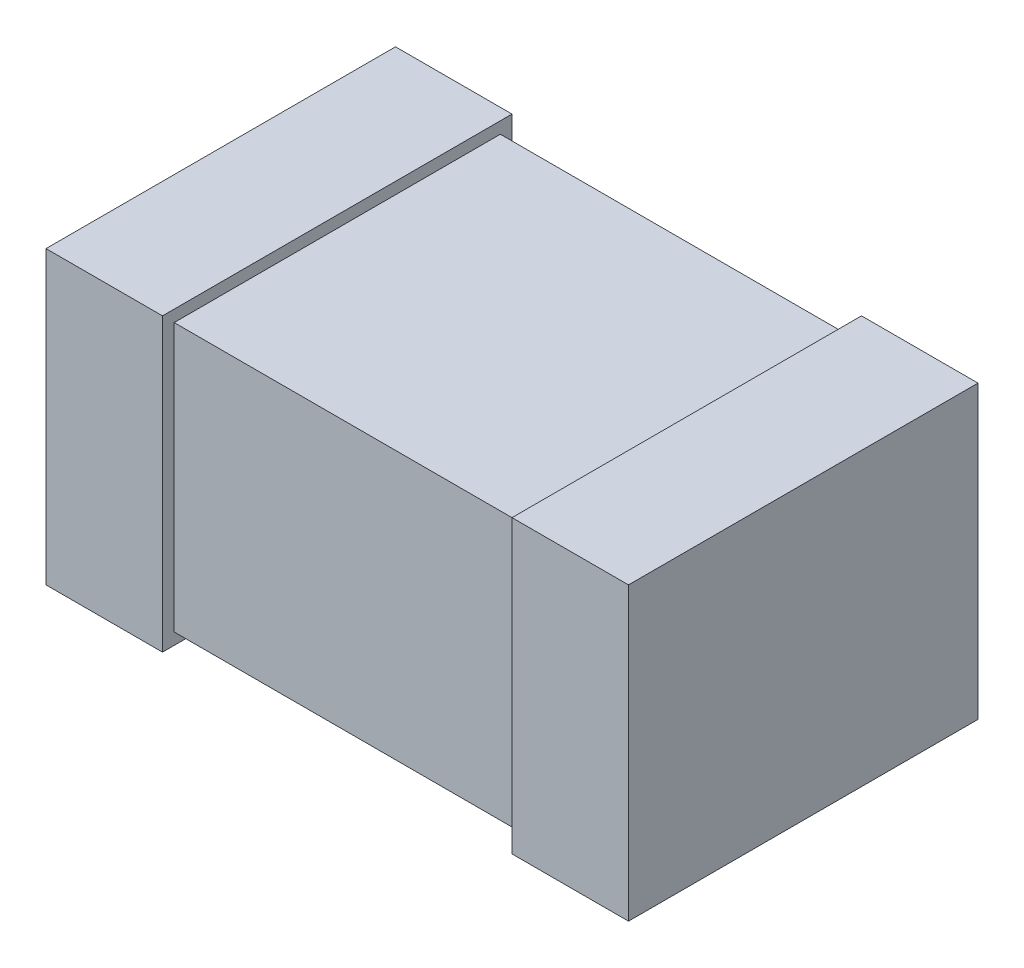
ISO-10303-21;
HEADER;
FILE_DESCRIPTION(('STEP AP214'),'2;1');
FILE_NAME('part.step','',(''),(''),'','','');
FILE_SCHEMA(('AUTOMOTIVE_DESIGN { 1 0 10303 214 1 1 1 1 }'));
ENDSEC;
DATA;
#1=APPLICATION_CONTEXT('core data for automotive mechanical design processes');
#2=APPLICATION_PROTOCOL_DEFINITION('international standard','automotive_design',2000,#1);
#3=PRODUCT_CONTEXT('',#1,'mechanical');
#4=PRODUCT('Part','Part','',(#3));
#5=PRODUCT_RELATED_PRODUCT_CATEGORY('part','',(#4));
#6=PRODUCT_DEFINITION_FORMATION('','',#4);
#7=PRODUCT_DEFINITION_CONTEXT('part definition',#1,'design');
#8=PRODUCT_DEFINITION('design','',#6,#7);
#9=PRODUCT_DEFINITION_SHAPE('','',#8);
#10=(LENGTH_UNIT() NAMED_UNIT(*) SI_UNIT(.MILLI.,.METRE.));
#11=(NAMED_UNIT(*) PLANE_ANGLE_UNIT() SI_UNIT($,.RADIAN.));
#12=(NAMED_UNIT(*) SI_UNIT($,.STERADIAN.) SOLID_ANGLE_UNIT());
#13=UNCERTAINTY_MEASURE_WITH_UNIT(LENGTH_MEASURE(1.E-05),#10,'distance_accuracy_value','');
#14=(GEOMETRIC_REPRESENTATION_CONTEXT(3) GLOBAL_UNCERTAINTY_ASSIGNED_CONTEXT((#13)) GLOBAL_UNIT_ASSIGNED_CONTEXT((#10,
#11,#12)) REPRESENTATION_CONTEXT('',''));
#15=CARTESIAN_POINT('',(0.,0.,0.));
#16=DIRECTION('',(0.,0.,1.));
#17=DIRECTION('',(1.,0.,0.));
#18=AXIS2_PLACEMENT_3D('',#15,#16,#17);
#19=CARTESIAN_POINT('',(0.5,-0.25,0.0762));
#20=DIRECTION('',(1.,0.,0.));
#21=DIRECTION('',(0.,1.,0.));
#22=AXIS2_PLACEMENT_3D('',#19,#20,#21);
#23=PLANE('',#22);
#24=DIRECTION('',(0.,1.,0.));
#25=VECTOR('',#24,1.);
#26=CARTESIAN_POINT('',(0.5,-0.25,0.0762));
#27=LINE('',#26,#25);
#28=CARTESIAN_POINT('',(0.5,-0.25,0.0762));
#29=VERTEX_POINT('',#28);
#30=CARTESIAN_POINT('',(0.5,0.25,0.0762));
#31=VERTEX_POINT('',#30);
#32=EDGE_CURVE('E196',#29,#31,#27,.T.);
#33=ORIENTED_EDGE('',*,*,#32,.T.);
#34=DIRECTION('',(0.,0.,1.));
#35=VECTOR('',#34,1.);
#36=CARTESIAN_POINT('',(0.5,0.25,0.0762));
#37=LINE('',#36,#35);
#38=CARTESIAN_POINT('',(0.5,0.25,0.6762));
#39=VERTEX_POINT('',#38);
#40=EDGE_CURVE('E168',#31,#39,#37,.T.);
#41=ORIENTED_EDGE('',*,*,#40,.T.);
#42=DIRECTION('',(0.,1.,0.));
#43=VECTOR('',#42,1.);
#44=CARTESIAN_POINT('',(0.5,-0.25,0.6762));
#45=LINE('',#44,#43);
#46=CARTESIAN_POINT('',(0.5,-0.25,0.6762));
#47=VERTEX_POINT('',#46);
#48=EDGE_CURVE('E163',#47,#39,#45,.T.);
#49=ORIENTED_EDGE('',*,*,#48,.F.);
#50=DIRECTION('',(0.,0.,1.));
#51=VECTOR('',#50,1.);
#52=CARTESIAN_POINT('',(0.5,-0.25,0.0762));
#53=LINE('',#52,#51);
#54=EDGE_CURVE('E178',#29,#47,#53,.T.);
#55=ORIENTED_EDGE('',*,*,#54,.F.);
#56=EDGE_LOOP('',(#33,#41,#49,#55));
#57=FACE_BOUND('',#56,.T.);
#58=ADVANCED_FACE('F16',(#57),#23,.T.);
#59=CARTESIAN_POINT('',(0.3,-0.23,0.0762));
#60=DIRECTION('',(0.,1.,0.));
#61=DIRECTION('',(1.,0.,0.));
#62=AXIS2_PLACEMENT_3D('',#59,#60,#61);
#63=PLANE('',#62);
#64=DIRECTION('',(-1.,0.,0.));
#65=VECTOR('',#64,1.);
#66=CARTESIAN_POINT('',(0.3,-0.23,0.6562));
#67=LINE('',#66,#65);
#68=CARTESIAN_POINT('',(0.3,-0.23,0.6562));
#69=VERTEX_POINT('',#68);
#70=CARTESIAN_POINT('',(-0.3,-0.23,0.6562));
#71=VERTEX_POINT('',#70);
#72=EDGE_CURVE('E11',#69,#71,#67,.T.);
#73=ORIENTED_EDGE('',*,*,#72,.T.);
#74=DIRECTION('',(0.,0.,-1.));
#75=VECTOR('',#74,1.);
#76=CARTESIAN_POINT('',(-0.3,-0.23,0.6562));
#77=LINE('',#76,#75);
#78=CARTESIAN_POINT('',(-0.3,-0.23,0.0962));
#79=VERTEX_POINT('',#78);
#80=EDGE_CURVE('E183',#71,#79,#77,.T.);
#81=ORIENTED_EDGE('',*,*,#80,.T.);
#82=DIRECTION('',(-1.,0.,0.));
#83=VECTOR('',#82,1.);
#84=CARTESIAN_POINT('',(0.3,-0.23,0.0962));
#85=LINE('',#84,#83);
#86=CARTESIAN_POINT('',(0.3,-0.23,0.0962));
#87=VERTEX_POINT('',#86);
#88=EDGE_CURVE('E217',#87,#79,#85,.T.);
#89=ORIENTED_EDGE('',*,*,#88,.F.);
#90=DIRECTION('',(0.,0.,-1.));
#91=VECTOR('',#90,1.);
#92=CARTESIAN_POINT('',(0.3,-0.23,0.6562));
#93=LINE('',#92,#91);
#94=EDGE_CURVE('E192',#69,#87,#93,.T.);
#95=ORIENTED_EDGE('',*,*,#94,.F.);
#96=EDGE_LOOP('',(#73,#81,#89,#95));
#97=FACE_BOUND('',#96,.T.);
#98=ADVANCED_FACE('F260',(#97),#63,.F.);
#99=CARTESIAN_POINT('',(0.3,0.25,0.6562));
#100=DIRECTION('',(0.,0.,-1.));
#101=DIRECTION('',(0.,-1.,0.));
#102=AXIS2_PLACEMENT_3D('',#99,#100,#101);
#103=PLANE('',#102);
#104=DIRECTION('',(1.,0.,0.));
#105=VECTOR('',#104,1.);
#106=CARTESIAN_POINT('',(-0.3,0.23,0.6562));
#107=LINE('',#106,#105);
#108=CARTESIAN_POINT('',(-0.3,0.23,0.6562));
#109=VERTEX_POINT('',#108);
#110=CARTESIAN_POINT('',(0.3,0.23,0.6562));
#111=VERTEX_POINT('',#110);
#112=EDGE_CURVE('E27',#109,#111,#107,.T.);
#113=ORIENTED_EDGE('',*,*,#112,.F.);
#114=DIRECTION('',(0.,-1.,0.));
#115=VECTOR('',#114,1.);
#116=CARTESIAN_POINT('',(-0.3,0.23,0.6562));
#117=LINE('',#116,#115);
#118=EDGE_CURVE('E184',#109,#71,#117,.T.);
#119=ORIENTED_EDGE('',*,*,#118,.T.);
#120=ORIENTED_EDGE('',*,*,#72,.F.);
#121=DIRECTION('',(0.,-1.,0.));
#122=VECTOR('',#121,1.);
#123=CARTESIAN_POINT('',(0.3,0.23,0.6562));
#124=LINE('',#123,#122);
#125=EDGE_CURVE('E188',#111,#69,#124,.T.);
#126=ORIENTED_EDGE('',*,*,#125,.F.);
#127=EDGE_LOOP('',(#113,#119,#120,#126));
#128=FACE_BOUND('',#127,.T.);
#129=ADVANCED_FACE('F265',(#128),#103,.F.);
#130=CARTESIAN_POINT('',(-0.3,0.23,0.0762));
#131=DIRECTION('',(0.,-1.,0.));
#132=DIRECTION('',(0.,0.,-1.));
#133=AXIS2_PLACEMENT_3D('',#130,#131,#132);
#134=PLANE('',#133);
#135=ORIENTED_EDGE('',*,*,#112,.T.);
#136=DIRECTION('',(0.,0.,-1.));
#137=VECTOR('',#136,1.);
#138=CARTESIAN_POINT('',(0.3,0.23,0.6562));
#139=LINE('',#138,#137);
#140=CARTESIAN_POINT('',(0.3,0.23,0.0962));
#141=VERTEX_POINT('',#140);
#142=EDGE_CURVE('E162',#111,#141,#139,.T.);
#143=ORIENTED_EDGE('',*,*,#142,.T.);
#144=DIRECTION('',(1.,0.,0.));
#145=VECTOR('',#144,1.);
#146=CARTESIAN_POINT('',(-0.3,0.23,0.0962));
#147=LINE('',#146,#145);
#148=CARTESIAN_POINT('',(-0.3,0.23,0.0962));
#149=VERTEX_POINT('',#148);
#150=EDGE_CURVE('E220',#149,#141,#147,.T.);
#151=ORIENTED_EDGE('',*,*,#150,.F.);
#152=DIRECTION('',(0.,0.,-1.));
#153=VECTOR('',#152,1.);
#154=CARTESIAN_POINT('',(-0.3,0.23,0.6562));
#155=LINE('',#154,#153);
#156=EDGE_CURVE('E187',#109,#149,#155,.T.);
#157=ORIENTED_EDGE('',*,*,#156,.F.);
#158=EDGE_LOOP('',(#135,#143,#151,#157));
#159=FACE_BOUND('',#158,.T.);
#160=ADVANCED_FACE('F356',(#159),#134,.F.);
#161=CARTESIAN_POINT('',(-0.3,0.25,0.0962));
#162=DIRECTION('',(0.,0.,1.));
#163=DIRECTION('',(1.,0.,0.));
#164=AXIS2_PLACEMENT_3D('',#161,#162,#163);
#165=PLANE('',#164);
#166=ORIENTED_EDGE('',*,*,#150,.T.);
#167=DIRECTION('',(0.,-1.,0.));
#168=VECTOR('',#167,1.);
#169=CARTESIAN_POINT('',(0.3,0.23,0.0962));
#170=LINE('',#169,#168);
#171=EDGE_CURVE('E159',#141,#87,#170,.T.);
#172=ORIENTED_EDGE('',*,*,#171,.T.);
#173=ORIENTED_EDGE('',*,*,#88,.T.);
#174=DIRECTION('',(0.,-1.,0.));
#175=VECTOR('',#174,1.);
#176=CARTESIAN_POINT('',(-0.3,0.23,0.0962));
#177=LINE('',#176,#175);
#178=EDGE_CURVE('E213',#149,#79,#177,.T.);
#179=ORIENTED_EDGE('',*,*,#178,.F.);
#180=EDGE_LOOP('',(#166,#172,#173,#179));
#181=FACE_BOUND('',#180,.T.);
#182=ADVANCED_FACE('F290',(#181),#165,.F.);
#183=CARTESIAN_POINT('',(0.3,0.23,0.0762));
#184=DIRECTION('',(1.,0.,0.));
#185=DIRECTION('',(0.,1.,0.));
#186=AXIS2_PLACEMENT_3D('',#183,#184,#185);
#187=PLANE('',#186);
#188=ORIENTED_EDGE('',*,*,#171,.F.);
#189=ORIENTED_EDGE('',*,*,#142,.F.);
#190=ORIENTED_EDGE('',*,*,#125,.T.);
#191=ORIENTED_EDGE('',*,*,#94,.T.);
#192=EDGE_LOOP('',(#188,#189,#190,#191));
#193=FACE_BOUND('',#192,.T.);
#194=DIRECTION('',(0.,-1.,0.));
#195=VECTOR('',#194,1.);
#196=CARTESIAN_POINT('',(0.3,0.25,0.6762));
#197=LINE('',#196,#195);
#198=CARTESIAN_POINT('',(0.3,0.25,0.6762));
#199=VERTEX_POINT('',#198);
#200=CARTESIAN_POINT('',(0.3,-0.25,0.6762));
#201=VERTEX_POINT('',#200);
#202=EDGE_CURVE('E212',#199,#201,#197,.T.);
#203=ORIENTED_EDGE('',*,*,#202,.F.);
#204=DIRECTION('',(0.,0.,1.));
#205=VECTOR('',#204,1.);
#206=CARTESIAN_POINT('',(0.3,0.25,0.0762));
#207=LINE('',#206,#205);
#208=CARTESIAN_POINT('',(0.3,0.25,0.0762));
#209=VERTEX_POINT('',#208);
#210=EDGE_CURVE('E169',#209,#199,#207,.T.);
#211=ORIENTED_EDGE('',*,*,#210,.F.);
#212=DIRECTION('',(0.,1.,0.));
#213=VECTOR('',#212,1.);
#214=CARTESIAN_POINT('',(0.3,-0.25,0.0762));
#215=LINE('',#214,#213);
#216=CARTESIAN_POINT('',(0.3,-0.25,0.0762));
#217=VERTEX_POINT('',#216);
#218=EDGE_CURVE('E144',#217,#209,#215,.T.);
#219=ORIENTED_EDGE('',*,*,#218,.F.);
#220=DIRECTION('',(0.,0.,1.));
#221=VECTOR('',#220,1.);
#222=CARTESIAN_POINT('',(0.3,-0.25,0.0762));
#223=LINE('',#222,#221);
#224=EDGE_CURVE('E174',#217,#201,#223,.T.);
#225=ORIENTED_EDGE('',*,*,#224,.T.);
#226=EDGE_LOOP('',(#203,#211,#219,#225));
#227=FACE_BOUND('',#226,.T.);
#228=ADVANCED_FACE('F285',(#193,#227),#187,.F.);
#229=CARTESIAN_POINT('',(0.,0.,0.6762));
#230=DIRECTION('',(0.,0.,1.));
#231=DIRECTION('',(1.,0.,0.));
#232=AXIS2_PLACEMENT_3D('',#229,#230,#231);
#233=PLANE('',#232);
#234=DIRECTION('',(0.,1.,0.));
#235=VECTOR('',#234,1.);
#236=CARTESIAN_POINT('',(-0.3,-0.25,0.6762));
#237=LINE('',#236,#235);
#238=CARTESIAN_POINT('',(-0.3,-0.25,0.6762));
#239=VERTEX_POINT('',#238);
#240=CARTESIAN_POINT('',(-0.3,0.25,0.6762));
#241=VERTEX_POINT('',#240);
#242=EDGE_CURVE('E133',#239,#241,#237,.T.);
#243=ORIENTED_EDGE('',*,*,#242,.T.);
#244=DIRECTION('',(-1.,0.,0.));
#245=VECTOR('',#244,1.);
#246=CARTESIAN_POINT('',(-0.3,0.25,0.6762));
#247=LINE('',#246,#245);
#248=CARTESIAN_POINT('',(-0.5,0.25,0.6762));
#249=VERTEX_POINT('',#248);
#250=EDGE_CURVE('E127',#241,#249,#247,.T.);
#251=ORIENTED_EDGE('',*,*,#250,.T.);
#252=DIRECTION('',(0.,-1.,0.));
#253=VECTOR('',#252,1.);
#254=CARTESIAN_POINT('',(-0.5,0.25,0.6762));
#255=LINE('',#254,#253);
#256=CARTESIAN_POINT('',(-0.5,-0.25,0.6762));
#257=VERTEX_POINT('',#256);
#258=EDGE_CURVE('E173',#249,#257,#255,.T.);
#259=ORIENTED_EDGE('',*,*,#258,.T.);
#260=DIRECTION('',(1.,0.,0.));
#261=VECTOR('',#260,1.);
#262=CARTESIAN_POINT('',(-0.5,-0.25,0.6762));
#263=LINE('',#262,#261);
#264=EDGE_CURVE('E180',#257,#239,#263,.T.);
#265=ORIENTED_EDGE('',*,*,#264,.T.);
#266=EDGE_LOOP('',(#243,#251,#259,#265));
#267=FACE_BOUND('',#266,.T.);
#268=ADVANCED_FACE('F248',(#267),#233,.T.);
#269=CARTESIAN_POINT('',(0.,0.,0.6762));
#270=DIRECTION('',(0.,0.,1.));
#271=DIRECTION('',(1.,0.,0.));
#272=AXIS2_PLACEMENT_3D('',#269,#270,#271);
#273=PLANE('',#272);
#274=ORIENTED_EDGE('',*,*,#202,.T.);
#275=DIRECTION('',(1.,0.,0.));
#276=VECTOR('',#275,1.);
#277=CARTESIAN_POINT('',(0.3,-0.25,0.6762));
#278=LINE('',#277,#276);
#279=EDGE_CURVE('E197',#201,#47,#278,.T.);
#280=ORIENTED_EDGE('',*,*,#279,.T.);
#281=ORIENTED_EDGE('',*,*,#48,.T.);
#282=DIRECTION('',(-1.,0.,0.));
#283=VECTOR('',#282,1.);
#284=CARTESIAN_POINT('',(0.5,0.25,0.6762));
#285=LINE('',#284,#283);
#286=EDGE_CURVE('E164',#39,#199,#285,.T.);
#287=ORIENTED_EDGE('',*,*,#286,.T.);
#288=EDGE_LOOP('',(#274,#280,#281,#287));
#289=FACE_BOUND('',#288,.T.);
#290=ADVANCED_FACE('F330',(#289),#273,.T.);
#291=CARTESIAN_POINT('',(0.5,0.25,0.0762));
#292=DIRECTION('',(0.,1.,0.));
#293=DIRECTION('',(1.,0.,0.));
#294=AXIS2_PLACEMENT_3D('',#291,#292,#293);
#295=PLANE('',#294);
#296=ORIENTED_EDGE('',*,*,#210,.T.);
#297=ORIENTED_EDGE('',*,*,#286,.F.);
#298=ORIENTED_EDGE('',*,*,#40,.F.);
#299=DIRECTION('',(-1.,0.,0.));
#300=VECTOR('',#299,1.);
#301=CARTESIAN_POINT('',(0.5,0.25,0.0762));
#302=LINE('',#301,#300);
#303=EDGE_CURVE('E204',#31,#209,#302,.T.);
#304=ORIENTED_EDGE('',*,*,#303,.T.);
#305=EDGE_LOOP('',(#296,#297,#298,#304));
#306=FACE_BOUND('',#305,.T.);
#307=ADVANCED_FACE('F346',(#306),#295,.T.);
#308=CARTESIAN_POINT('',(0.5,0.25,0.0762));
#309=DIRECTION('',(0.,1.,0.));
#310=DIRECTION('',(1.,0.,0.));
#311=AXIS2_PLACEMENT_3D('',#308,#309,#310);
#312=PLANE('',#311);
#313=DIRECTION('',(0.,0.,1.));
#314=VECTOR('',#313,1.);
#315=CARTESIAN_POINT('',(-0.3,0.25,0.0762));
#316=LINE('',#315,#314);
#317=CARTESIAN_POINT('',(-0.3,0.25,0.0762));
#318=VERTEX_POINT('',#317);
#319=EDGE_CURVE('E121',#318,#241,#316,.T.);
#320=ORIENTED_EDGE('',*,*,#319,.F.);
#321=DIRECTION('',(-1.,0.,0.));
#322=VECTOR('',#321,1.);
#323=CARTESIAN_POINT('',(-0.3,0.25,0.0762));
#324=LINE('',#323,#322);
#325=CARTESIAN_POINT('',(-0.5,0.25,0.0762));
#326=VERTEX_POINT('',#325);
#327=EDGE_CURVE('E124',#318,#326,#324,.T.);
#328=ORIENTED_EDGE('',*,*,#327,.T.);
#329=DIRECTION('',(0.,0.,1.));
#330=VECTOR('',#329,1.);
#331=CARTESIAN_POINT('',(-0.5,0.25,0.0762));
#332=LINE('',#331,#330);
#333=EDGE_CURVE('E170',#326,#249,#332,.T.);
#334=ORIENTED_EDGE('',*,*,#333,.T.);
#335=ORIENTED_EDGE('',*,*,#250,.F.);
#336=EDGE_LOOP('',(#320,#328,#334,#335));
#337=FACE_BOUND('',#336,.T.);
#338=ADVANCED_FACE('F18',(#337),#312,.T.);
#339=CARTESIAN_POINT('',(-0.5,0.25,0.0762));
#340=DIRECTION('',(-1.,0.,0.));
#341=DIRECTION('',(0.,0.,1.));
#342=AXIS2_PLACEMENT_3D('',#339,#340,#341);
#343=PLANE('',#342);
#344=DIRECTION('',(0.,-1.,0.));
#345=VECTOR('',#344,1.);
#346=CARTESIAN_POINT('',(-0.5,0.25,0.0762));
#347=LINE('',#346,#345);
#348=CARTESIAN_POINT('',(-0.5,-0.25,0.0762));
#349=VERTEX_POINT('',#348);
#350=EDGE_CURVE('E142',#326,#349,#347,.T.);
#351=ORIENTED_EDGE('',*,*,#350,.T.);
#352=DIRECTION('',(0.,0.,1.));
#353=VECTOR('',#352,1.);
#354=CARTESIAN_POINT('',(-0.5,-0.25,0.0762));
#355=LINE('',#354,#353);
#356=EDGE_CURVE('E179',#349,#257,#355,.T.);
#357=ORIENTED_EDGE('',*,*,#356,.T.);
#358=ORIENTED_EDGE('',*,*,#258,.F.);
#359=ORIENTED_EDGE('',*,*,#333,.F.);
#360=EDGE_LOOP('',(#351,#357,#358,#359));
#361=FACE_BOUND('',#360,.T.);
#362=ADVANCED_FACE('F251',(#361),#343,.T.);
#363=CARTESIAN_POINT('',(-0.5,-0.25,0.0762));
#364=DIRECTION('',(0.,-1.,0.));
#365=DIRECTION('',(0.,0.,-1.));
#366=AXIS2_PLACEMENT_3D('',#363,#364,#365);
#367=PLANE('',#366);
#368=ORIENTED_EDGE('',*,*,#224,.F.);
#369=DIRECTION('',(1.,0.,0.));
#370=VECTOR('',#369,1.);
#371=CARTESIAN_POINT('',(0.3,-0.25,0.0762));
#372=LINE('',#371,#370);
#373=EDGE_CURVE('E134',#217,#29,#372,.T.);
#374=ORIENTED_EDGE('',*,*,#373,.T.);
#375=ORIENTED_EDGE('',*,*,#54,.T.);
#376=ORIENTED_EDGE('',*,*,#279,.F.);
#377=EDGE_LOOP('',(#368,#374,#375,#376));
#378=FACE_BOUND('',#377,.T.);
#379=ADVANCED_FACE('F278',(#378),#367,.T.);
#380=CARTESIAN_POINT('',(-0.5,-0.25,0.0762));
#381=DIRECTION('',(0.,-1.,0.));
#382=DIRECTION('',(0.,0.,-1.));
#383=AXIS2_PLACEMENT_3D('',#380,#381,#382);
#384=PLANE('',#383);
#385=DIRECTION('',(0.,0.,1.));
#386=VECTOR('',#385,1.);
#387=CARTESIAN_POINT('',(-0.3,-0.25,0.0762));
#388=LINE('',#387,#386);
#389=CARTESIAN_POINT('',(-0.3,-0.25,0.0762));
#390=VERTEX_POINT('',#389);
#391=EDGE_CURVE('E20',#390,#239,#388,.T.);
#392=ORIENTED_EDGE('',*,*,#391,.T.);
#393=ORIENTED_EDGE('',*,*,#264,.F.);
#394=ORIENTED_EDGE('',*,*,#356,.F.);
#395=DIRECTION('',(1.,0.,0.));
#396=VECTOR('',#395,1.);
#397=CARTESIAN_POINT('',(-0.5,-0.25,0.0762));
#398=LINE('',#397,#396);
#399=EDGE_CURVE('E149',#349,#390,#398,.T.);
#400=ORIENTED_EDGE('',*,*,#399,.T.);
#401=EDGE_LOOP('',(#392,#393,#394,#400));
#402=FACE_BOUND('',#401,.T.);
#403=ADVANCED_FACE('F253',(#402),#384,.T.);
#404=CARTESIAN_POINT('',(-0.3,0.25,0.0762));
#405=DIRECTION('',(-1.,0.,0.));
#406=DIRECTION('',(0.,0.,1.));
#407=AXIS2_PLACEMENT_3D('',#404,#405,#406);
#408=PLANE('',#407);
#409=ORIENTED_EDGE('',*,*,#118,.F.);
#410=ORIENTED_EDGE('',*,*,#156,.T.);
#411=ORIENTED_EDGE('',*,*,#178,.T.);
#412=ORIENTED_EDGE('',*,*,#80,.F.);
#413=EDGE_LOOP('',(#409,#410,#411,#412));
#414=FACE_BOUND('',#413,.T.);
#415=DIRECTION('',(0.,-1.,0.));
#416=VECTOR('',#415,1.);
#417=CARTESIAN_POINT('',(-0.3,0.25,0.0762));
#418=LINE('',#417,#416);
#419=EDGE_CURVE('E140',#318,#390,#418,.T.);
#420=ORIENTED_EDGE('',*,*,#419,.F.);
#421=ORIENTED_EDGE('',*,*,#319,.T.);
#422=ORIENTED_EDGE('',*,*,#242,.F.);
#423=ORIENTED_EDGE('',*,*,#391,.F.);
#424=EDGE_LOOP('',(#420,#421,#422,#423));
#425=FACE_BOUND('',#424,.T.);
#426=ADVANCED_FACE('F145',(#414,#425),#408,.F.);
#427=CARTESIAN_POINT('',(0.,0.,0.0762));
#428=DIRECTION('',(0.,0.,1.));
#429=DIRECTION('',(1.,0.,0.));
#430=AXIS2_PLACEMENT_3D('',#427,#428,#429);
#431=PLANE('',#430);
#432=ORIENTED_EDGE('',*,*,#218,.T.);
#433=ORIENTED_EDGE('',*,*,#303,.F.);
#434=ORIENTED_EDGE('',*,*,#32,.F.);
#435=ORIENTED_EDGE('',*,*,#373,.F.);
#436=EDGE_LOOP('',(#432,#433,#434,#435));
#437=FACE_BOUND('',#436,.T.);
#438=ADVANCED_FACE('F302',(#437),#431,.F.);
#439=CARTESIAN_POINT('',(0.,0.,0.0762));
#440=DIRECTION('',(0.,0.,1.));
#441=DIRECTION('',(1.,0.,0.));
#442=AXIS2_PLACEMENT_3D('',#439,#440,#441);
#443=PLANE('',#442);
#444=ORIENTED_EDGE('',*,*,#419,.T.);
#445=ORIENTED_EDGE('',*,*,#399,.F.);
#446=ORIENTED_EDGE('',*,*,#350,.F.);
#447=ORIENTED_EDGE('',*,*,#327,.F.);
#448=EDGE_LOOP('',(#444,#445,#446,#447));
#449=FACE_BOUND('',#448,.T.);
#450=ADVANCED_FACE('F138',(#449),#443,.F.);
#451=CLOSED_SHELL('',(#58,#98,#129,#160,#182,#228,#268,#290,#307,#338,#362,#379,#403,#426,#438,#450));
#452=MANIFOLD_SOLID_BREP('B1',#451);
#453=ADVANCED_BREP_SHAPE_REPRESENTATION('',(#18,#452),#14);
#454=SHAPE_DEFINITION_REPRESENTATION(#9,#453);
ENDSEC;
END-ISO-10303-21;
